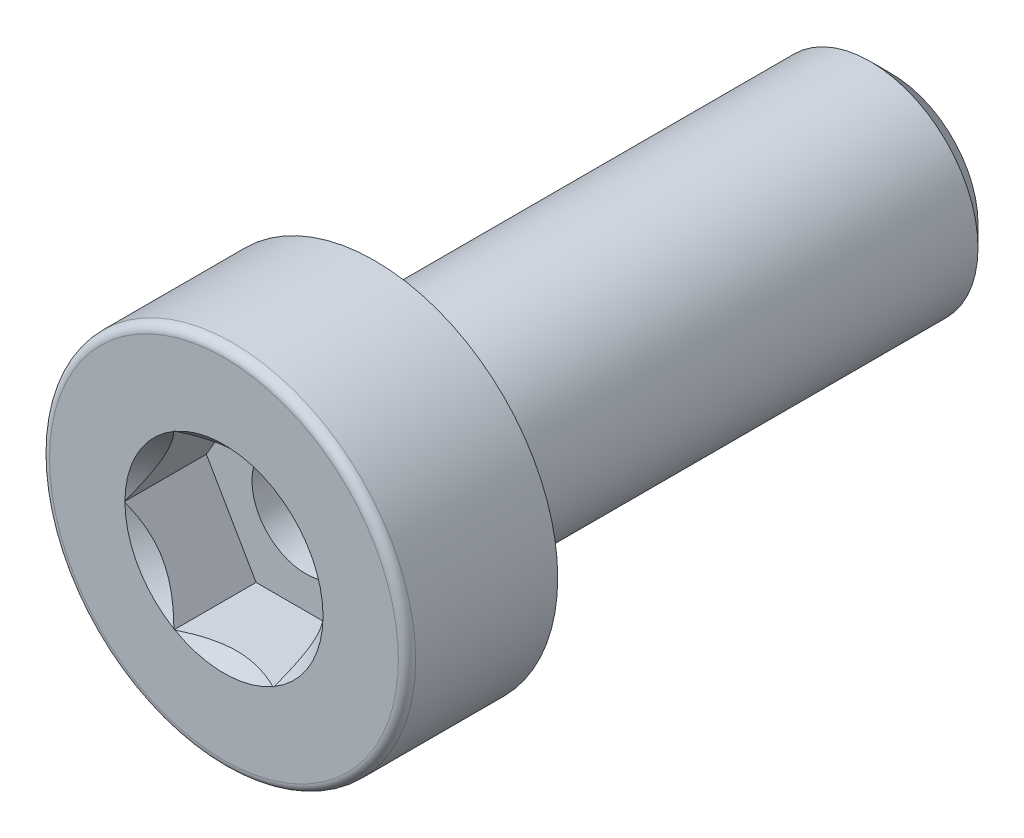
ISO-10303-21;
HEADER;
FILE_DESCRIPTION(('STEP AP214'),'2;1');
FILE_NAME('part.step','',(''),(''),'','','');
FILE_SCHEMA(('AUTOMOTIVE_DESIGN { 1 0 10303 214 1 1 1 1 }'));
ENDSEC;
DATA;
#1=APPLICATION_CONTEXT('core data for automotive mechanical design processes');
#2=APPLICATION_PROTOCOL_DEFINITION('international standard','automotive_design',2000,#1);
#3=PRODUCT_CONTEXT('',#1,'mechanical');
#4=PRODUCT('Part','Part','',(#3));
#5=PRODUCT_RELATED_PRODUCT_CATEGORY('part','',(#4));
#6=PRODUCT_DEFINITION_FORMATION('','',#4);
#7=PRODUCT_DEFINITION_CONTEXT('part definition',#1,'design');
#8=PRODUCT_DEFINITION('design','',#6,#7);
#9=PRODUCT_DEFINITION_SHAPE('','',#8);
#10=(LENGTH_UNIT() NAMED_UNIT(*) SI_UNIT(.MILLI.,.METRE.));
#11=(NAMED_UNIT(*) PLANE_ANGLE_UNIT() SI_UNIT($,.RADIAN.));
#12=(NAMED_UNIT(*) SI_UNIT($,.STERADIAN.) SOLID_ANGLE_UNIT());
#13=UNCERTAINTY_MEASURE_WITH_UNIT(LENGTH_MEASURE(1.E-05),#10,'distance_accuracy_value','');
#14=(GEOMETRIC_REPRESENTATION_CONTEXT(3) GLOBAL_UNCERTAINTY_ASSIGNED_CONTEXT((#13)) GLOBAL_UNIT_ASSIGNED_CONTEXT((#10,
#11,#12)) REPRESENTATION_CONTEXT('',''));
#15=CARTESIAN_POINT('',(0.,0.,0.));
#16=DIRECTION('',(0.,0.,1.));
#17=DIRECTION('',(1.,0.,0.));
#18=AXIS2_PLACEMENT_3D('',#15,#16,#17);
#19=CARTESIAN_POINT('',(15.5,0.,3.49999999991724));
#20=DIRECTION('',(0.,0.,1.));
#21=DIRECTION('',(1.,0.,0.));
#22=AXIS2_PLACEMENT_3D('',#19,#20,#21);
#23=CONICAL_SURFACE('',#22,1.2499999997176,1.0471975509);
#24=CARTESIAN_POINT('',(15.5,0.,3.5));
#25=DIRECTION('',(0.,0.,-1.));
#26=DIRECTION('',(-1.,0.,0.));
#27=AXIS2_PLACEMENT_3D('',#24,#25,#26);
#28=CIRCLE('',#27,1.25);
#29=CARTESIAN_POINT('',(14.25,0.,3.5));
#30=VERTEX_POINT('',#29);
#31=EDGE_CURVE('E387',#30,#30,#28,.F.);
#32=ORIENTED_EDGE('',*,*,#31,.T.);
#33=EDGE_LOOP('',(#32));
#34=FACE_BOUND('',#33,.T.);
#35=CARTESIAN_POINT('',(15.5000000002588,0.,2.77831216348545));
#36=VERTEX_POINT('',#35);
#37=VERTEX_LOOP('',#36);
#38=FACE_BOUND('',#37,.T.);
#39=ADVANCED_FACE('F16',(#34,#38),#23,.F.);
#40=CARTESIAN_POINT('',(15.5,0.,5.5));
#41=DIRECTION('',(0.,0.,-1.));
#42=DIRECTION('',(-1.,0.,0.));
#43=AXIS2_PLACEMENT_3D('',#40,#41,#42);
#44=CYLINDRICAL_SURFACE('',#43,1.25);
#45=ORIENTED_EDGE('',*,*,#31,.F.);
#46=EDGE_LOOP('',(#45));
#47=FACE_BOUND('',#46,.T.);
#48=CARTESIAN_POINT('',(15.5,0.,5.6));
#49=DIRECTION('',(0.,0.,-1.));
#50=DIRECTION('',(-1.,0.,0.));
#51=AXIS2_PLACEMENT_3D('',#48,#49,#50);
#52=CIRCLE('',#51,1.25);
#53=CARTESIAN_POINT('',(14.25,0.,5.6));
#54=VERTEX_POINT('',#53);
#55=EDGE_CURVE('E343',#54,#54,#52,.T.);
#56=ORIENTED_EDGE('',*,*,#55,.F.);
#57=EDGE_LOOP('',(#56));
#58=FACE_BOUND('',#57,.T.);
#59=ADVANCED_FACE('F438',(#47,#58),#44,.F.);
#60=CARTESIAN_POINT('',(15.5,0.,5.6));
#61=DIRECTION('',(0.,0.,1.));
#62=DIRECTION('',(1.,0.,0.));
#63=AXIS2_PLACEMENT_3D('',#60,#61,#62);
#64=PLANE('',#63);
#65=DIRECTION('',(-0.5,0.866025403784439,0.));
#66=VECTOR('',#65,1.);
#67=CARTESIAN_POINT('',(17.8094010767585,0.,5.6));
#68=LINE('',#67,#66);
#69=CARTESIAN_POINT('',(17.8094010767585,0.,5.6));
#70=VERTEX_POINT('',#69);
#71=CARTESIAN_POINT('',(16.6547005383793,1.99999999999999,5.6));
#72=VERTEX_POINT('',#71);
#73=EDGE_CURVE('E318',#70,#72,#68,.T.);
#74=ORIENTED_EDGE('',*,*,#73,.T.);
#75=DIRECTION('',(1.,0.,0.));
#76=VECTOR('',#75,1.);
#77=CARTESIAN_POINT('',(16.6547005383793,2.,5.6));
#78=LINE('',#77,#76);
#79=CARTESIAN_POINT('',(14.3452994616207,2.,5.6));
#80=VERTEX_POINT('',#79);
#81=EDGE_CURVE('E328',#72,#80,#78,.F.);
#82=ORIENTED_EDGE('',*,*,#81,.T.);
#83=DIRECTION('',(-0.5,-0.866025403784439,0.));
#84=VECTOR('',#83,1.);
#85=CARTESIAN_POINT('',(14.3452994616207,2.,5.6));
#86=LINE('',#85,#84);
#87=CARTESIAN_POINT('',(13.1905989232415,0.,5.6));
#88=VERTEX_POINT('',#87);
#89=EDGE_CURVE('E337',#80,#88,#86,.T.);
#90=ORIENTED_EDGE('',*,*,#89,.T.);
#91=DIRECTION('',(0.5,-0.866025403784439,0.));
#92=VECTOR('',#91,1.);
#93=CARTESIAN_POINT('',(13.1905989232415,0.,5.6));
#94=LINE('',#93,#92);
#95=CARTESIAN_POINT('',(14.3452994616207,-1.99999999999999,5.6));
#96=VERTEX_POINT('',#95);
#97=EDGE_CURVE('E128',#88,#96,#94,.T.);
#98=ORIENTED_EDGE('',*,*,#97,.T.);
#99=DIRECTION('',(1.,0.,0.));
#100=VECTOR('',#99,1.);
#101=CARTESIAN_POINT('',(14.3452994616207,-2.,5.6));
#102=LINE('',#101,#100);
#103=CARTESIAN_POINT('',(16.6547005383793,-2.,5.6));
#104=VERTEX_POINT('',#103);
#105=EDGE_CURVE('E348',#96,#104,#102,.T.);
#106=ORIENTED_EDGE('',*,*,#105,.T.);
#107=DIRECTION('',(0.5,0.866025403784439,0.));
#108=VECTOR('',#107,1.);
#109=CARTESIAN_POINT('',(16.6547005383793,-2.,5.6));
#110=LINE('',#109,#108);
#111=EDGE_CURVE('E308',#104,#70,#110,.T.);
#112=ORIENTED_EDGE('',*,*,#111,.T.);
#113=EDGE_LOOP('',(#74,#82,#90,#98,#106,#112));
#114=FACE_BOUND('',#113,.T.);
#115=ORIENTED_EDGE('',*,*,#55,.T.);
#116=EDGE_LOOP('',(#115));
#117=FACE_BOUND('',#116,.T.);
#118=ADVANCED_FACE('F435',(#114,#117),#64,.T.);
#119=CARTESIAN_POINT('',(13.1905989232415,0.,7.5));
#120=DIRECTION('',(-0.866025403784439,-0.5,0.));
#121=DIRECTION('',(0.5,-0.866025403784439,0.));
#122=AXIS2_PLACEMENT_3D('',#119,#120,#121);
#123=PLANE('',#122);
#124=DIRECTION('',(0.5,-0.866025403784439,0.));
#125=VECTOR('',#124,1.);
#126=CARTESIAN_POINT('',(13.1905989232415,0.,7.5));
#127=LINE('',#126,#125);
#128=CARTESIAN_POINT('',(14.3452994616207,-1.99999999999999,7.5));
#129=VERTEX_POINT('',#128);
#130=CARTESIAN_POINT('',(14.3358400270295,-1.9836157786771,7.49999999998885));
#131=VERTEX_POINT('',#130);
#132=EDGE_CURVE('E119',#129,#131,#127,.F.);
#133=ORIENTED_EDGE('',*,*,#132,.F.);
#134=DIRECTION('',(0.,0.,-1.));
#135=VECTOR('',#134,1.);
#136=CARTESIAN_POINT('',(14.3452994616207,-2.,7.5));
#137=LINE('',#136,#135);
#138=EDGE_CURVE('E298',#129,#96,#137,.T.);
#139=ORIENTED_EDGE('',*,*,#138,.T.);
#140=ORIENTED_EDGE('',*,*,#97,.F.);
#141=DIRECTION('',(0.,0.,1.));
#142=VECTOR('',#141,1.);
#143=CARTESIAN_POINT('',(13.1905989232415,0.,7.5));
#144=LINE('',#143,#142);
#145=CARTESIAN_POINT('',(13.1905989232415,0.,7.5));
#146=VERTEX_POINT('',#145);
#147=EDGE_CURVE('E333',#88,#146,#144,.T.);
#148=ORIENTED_EDGE('',*,*,#147,.T.);
#149=DIRECTION('',(0.5,-0.866025403784439,0.));
#150=VECTOR('',#149,1.);
#151=CARTESIAN_POINT('',(13.1905989232415,0.,7.5));
#152=LINE('',#151,#150);
#153=CARTESIAN_POINT('',(13.2000583578327,-0.0163842213229064,7.49999999998884));
#154=VERTEX_POINT('',#153);
#155=EDGE_CURVE('E113',#154,#146,#152,.F.);
#156=ORIENTED_EDGE('',*,*,#155,.F.);
#157=CARTESIAN_POINT('',(13.2000583578463,-0.0163842213417562,7.49999999997869));
#158=CARTESIAN_POINT('',(13.2391841252196,-0.0841520383204332,7.46139126551529));
#159=CARTESIAN_POINT('',(13.2789583547345,-0.153043024673416,7.42509450591591));
#160=CARTESIAN_POINT('',(13.3600294371282,-0.293462258404636,7.35871592055915));
#161=CARTESIAN_POINT('',(13.401333516474,-0.365003022391175,7.32866971216273));
#162=CARTESIAN_POINT('',(13.4846145969375,-0.50925008506292,7.27724746085434));
#163=CARTESIAN_POINT('',(13.5265716753271,-0.581921876570894,7.25574596548101));
#164=CARTESIAN_POINT('',(13.6113818208177,-0.728817357558076,7.22266553527469));
#165=CARTESIAN_POINT('',(13.6542324998209,-0.80303691073037,7.2110629454747));
#166=CARTESIAN_POINT('',(13.7285536802689,-0.931764971344884,7.20057444947973));
#167=CARTESIAN_POINT('',(13.7599355997019,-0.986120050241787,7.19908068822313));
#168=CARTESIAN_POINT('',(13.8226427676828,-1.09473205118354,7.20200867398585));
#169=CARTESIAN_POINT('',(13.8539679930386,-1.14898893305822,7.20643245489716));
#170=CARTESIAN_POINT('',(13.9163159125854,-1.25697869745949,7.22094215811644));
#171=CARTESIAN_POINT('',(13.9473382530807,-1.3107109673671,7.23103404383934));
#172=CARTESIAN_POINT('',(14.008846809773,-1.41724691265832,7.25633229226997));
#173=CARTESIAN_POINT('',(14.0393330689068,-1.47005066241089,7.2715382433899));
#174=CARTESIAN_POINT('',(14.1155007273443,-1.60197691671824,7.31551246780065));
#175=CARTESIAN_POINT('',(14.1607532237502,-1.68035653966256,7.34720930819536));
#176=CARTESIAN_POINT('',(14.2495490778406,-1.8341554704485,7.41837525258773));
#177=CARTESIAN_POINT('',(14.2930975421851,-1.90958362328479,7.45781859299645));
#178=CARTESIAN_POINT('',(14.3358400270181,-1.98361577865738,7.4999999999776));
#179=B_SPLINE_CURVE_WITH_KNOTS('',3,(#157,#158,#159,#160,#161,#162,#163,#164,#165,#166,#167,
#168,#169,#170,#171,#172,#173,#174,#175,#176,#177,#178),.UNSPECIFIED.,.F.,.F.,(4,2,2,2,2,2,2,2,
2,2,4),(0.,0.261948226148952,0.525350520146531,0.784728452727885,1.04348481149605,
1.23156297176626,1.41970579215339,1.60804692946322,1.79637291241682,2.08361007423832,
2.36990763376431),.UNSPECIFIED.);
#180=EDGE_CURVE('E130',#154,#131,#179,.T.);
#181=ORIENTED_EDGE('',*,*,#180,.T.);
#182=EDGE_LOOP('',(#133,#139,#140,#148,#156,#181));
#183=FACE_BOUND('',#182,.T.);
#184=ADVANCED_FACE('F131',(#183),#123,.F.);
#185=CARTESIAN_POINT('',(14.3452994616207,2.,7.5));
#186=DIRECTION('',(-0.866025403784439,0.5,0.));
#187=DIRECTION('',(-0.5,-0.866025403784439,0.));
#188=AXIS2_PLACEMENT_3D('',#185,#186,#187);
#189=PLANE('',#188);
#190=DIRECTION('',(-0.5,-0.866025403784439,0.));
#191=VECTOR('',#190,1.);
#192=CARTESIAN_POINT('',(14.3452994616207,2.,7.5));
#193=LINE('',#192,#191);
#194=CARTESIAN_POINT('',(13.2000583578327,0.0163842213229675,7.49999999998886));
#195=VERTEX_POINT('',#194);
#196=EDGE_CURVE('E329',#146,#195,#193,.F.);
#197=ORIENTED_EDGE('',*,*,#196,.F.);
#198=ORIENTED_EDGE('',*,*,#147,.F.);
#199=ORIENTED_EDGE('',*,*,#89,.F.);
#200=DIRECTION('',(0.,0.,1.));
#201=VECTOR('',#200,1.);
#202=CARTESIAN_POINT('',(14.3452994616207,2.,7.5));
#203=LINE('',#202,#201);
#204=CARTESIAN_POINT('',(14.3452994616207,2.,7.5));
#205=VERTEX_POINT('',#204);
#206=EDGE_CURVE('E323',#80,#205,#203,.T.);
#207=ORIENTED_EDGE('',*,*,#206,.T.);
#208=DIRECTION('',(-0.5,-0.866025403784439,0.));
#209=VECTOR('',#208,1.);
#210=CARTESIAN_POINT('',(14.3452994616207,2.,7.5));
#211=LINE('',#210,#209);
#212=CARTESIAN_POINT('',(14.3358400270295,1.98361577867708,7.49999999998886));
#213=VERTEX_POINT('',#212);
#214=EDGE_CURVE('E127',#213,#205,#211,.F.);
#215=ORIENTED_EDGE('',*,*,#214,.F.);
#216=CARTESIAN_POINT('',(14.3358400270199,1.98361577865595,7.49999999997874));
#217=CARTESIAN_POINT('',(14.296714259644,1.91584796167876,7.46139126551533));
#218=CARTESIAN_POINT('',(14.2569400301281,1.84695697532639,7.42509450591596));
#219=CARTESIAN_POINT('',(14.1758689477337,1.70653774159561,7.35871592055919));
#220=CARTESIAN_POINT('',(14.1345648683881,1.63499697760891,7.32866971216278));
#221=CARTESIAN_POINT('',(14.0512837879248,1.49074991493705,7.27724746085438));
#222=CARTESIAN_POINT('',(14.0093267095352,1.41807812342911,7.25574596548105));
#223=CARTESIAN_POINT('',(13.9245165640445,1.27118264244196,7.22266553527473));
#224=CARTESIAN_POINT('',(13.8816658850413,1.19696308926966,7.21106294547474));
#225=CARTESIAN_POINT('',(13.8073447045933,1.06823502865514,7.20057444947977));
#226=CARTESIAN_POINT('',(13.7759627851603,1.01387994975823,7.19908068822317));
#227=CARTESIAN_POINT('',(13.7132556171794,0.905267948816477,7.2020086739859));
#228=CARTESIAN_POINT('',(13.6819303918236,0.8510110669418,7.2064324548972));
#229=CARTESIAN_POINT('',(13.6195824722769,0.743021302540531,7.22094215811648));
#230=CARTESIAN_POINT('',(13.5885601317815,0.689289032632917,7.23103404383939));
#231=CARTESIAN_POINT('',(13.5270515750893,0.582753087341689,7.25633229227001));
#232=CARTESIAN_POINT('',(13.4965653159554,0.529949337589121,7.27153824338994));
#233=CARTESIAN_POINT('',(13.4203976575179,0.398023083281777,7.31551246780069));
#234=CARTESIAN_POINT('',(13.375145161112,0.319643460337462,7.34720930819539));
#235=CARTESIAN_POINT('',(13.2863493070217,0.165844529551535,7.41837525258776));
#236=CARTESIAN_POINT('',(13.2428008426772,0.090416376715251,7.45781859299647));
#237=CARTESIAN_POINT('',(13.2000583578441,0.0163842213426684,7.49999999997762));
#238=B_SPLINE_CURVE_WITH_KNOTS('',3,(#216,#217,#218,#219,#220,#221,#222,#223,#224,#225,#226,
#227,#228,#229,#230,#231,#232,#233,#234,#235,#236,#237),.UNSPECIFIED.,.F.,.F.,(4,2,2,2,2,2,2,2,
2,2,4),(0.,0.261948226148953,0.525350520146534,0.784728452727887,1.04348481149605,
1.23156297176626,1.4197057921534,1.60804692946323,1.79637291241684,2.08361007423831,
2.36990763376428),.UNSPECIFIED.);
#239=EDGE_CURVE('E133',#213,#195,#238,.T.);
#240=ORIENTED_EDGE('',*,*,#239,.T.);
#241=EDGE_LOOP('',(#197,#198,#199,#207,#215,#240));
#242=FACE_BOUND('',#241,.T.);
#243=ADVANCED_FACE('F204',(#242),#189,.F.);
#244=CARTESIAN_POINT('',(16.6547005383793,2.,7.5));
#245=DIRECTION('',(0.,1.,0.));
#246=DIRECTION('',(0.,0.,1.));
#247=AXIS2_PLACEMENT_3D('',#244,#245,#246);
#248=PLANE('',#247);
#249=DIRECTION('',(1.,0.,0.));
#250=VECTOR('',#249,1.);
#251=CARTESIAN_POINT('',(16.6547005383793,2.,7.5));
#252=LINE('',#251,#250);
#253=CARTESIAN_POINT('',(14.3642183308032,2.,7.49999999998885));
#254=VERTEX_POINT('',#253);
#255=EDGE_CURVE('E319',#205,#254,#252,.T.);
#256=ORIENTED_EDGE('',*,*,#255,.F.);
#257=ORIENTED_EDGE('',*,*,#206,.F.);
#258=ORIENTED_EDGE('',*,*,#81,.F.);
#259=DIRECTION('',(0.,0.,1.));
#260=VECTOR('',#259,1.);
#261=CARTESIAN_POINT('',(16.6547005383793,1.99999999999998,7.5));
#262=LINE('',#261,#260);
#263=CARTESIAN_POINT('',(16.6547005383793,1.99999999999999,7.5));
#264=VERTEX_POINT('',#263);
#265=EDGE_CURVE('E313',#72,#264,#262,.T.);
#266=ORIENTED_EDGE('',*,*,#265,.T.);
#267=DIRECTION('',(1.,0.,0.));
#268=VECTOR('',#267,1.);
#269=CARTESIAN_POINT('',(16.6547005383793,2.,7.5));
#270=LINE('',#269,#268);
#271=CARTESIAN_POINT('',(16.6357816691968,2.,7.49999999998885));
#272=VERTEX_POINT('',#271);
#273=EDGE_CURVE('E326',#272,#264,#270,.T.);
#274=ORIENTED_EDGE('',*,*,#273,.F.);
#275=CARTESIAN_POINT('',(16.6357816691737,1.9999999999977,7.49999999997871));
#276=CARTESIAN_POINT('',(16.5575301344245,1.99999999999917,7.46139126551531));
#277=CARTESIAN_POINT('',(16.4779816753936,1.99999999999978,7.42509450591593));
#278=CARTESIAN_POINT('',(16.3158395106056,2.00000000000022,7.35871592055916));
#279=CARTESIAN_POINT('',(16.2332313519142,2.00000000000006,7.32866971216274));
#280=CARTESIAN_POINT('',(16.0666691909874,1.99999999999994,7.27724746085434));
#281=CARTESIAN_POINT('',(15.9827550342082,1.99999999999998,7.25574596548101));
#282=CARTESIAN_POINT('',(15.8131347432268,2.00000000000002,7.22266553527469));
#283=CARTESIAN_POINT('',(15.7274333852205,2.,7.2110629454747));
#284=CARTESIAN_POINT('',(15.5787910243244,2.,7.20057444947973));
#285=CARTESIAN_POINT('',(15.5160271854585,2.,7.19908068822313));
#286=CARTESIAN_POINT('',(15.3906128494966,2.,7.20200867398585));
#287=CARTESIAN_POINT('',(15.3279623987851,2.,7.20643245489716));
#288=CARTESIAN_POINT('',(15.2032665596915,2.,7.22094215811644));
#289=CARTESIAN_POINT('',(15.1412218787009,2.,7.23103404383935));
#290=CARTESIAN_POINT('',(15.0182047653163,2.,7.25633229226997));
#291=CARTESIAN_POINT('',(14.9572322470486,2.,7.2715382433899));
#292=CARTESIAN_POINT('',(14.8048969301736,2.,7.31551246780066));
#293=CARTESIAN_POINT('',(14.7143919373618,2.,7.34720930819536));
#294=CARTESIAN_POINT('',(14.5368002291811,2.,7.41837525258774));
#295=CARTESIAN_POINT('',(14.4497033004921,2.,7.45781859299646));
#296=CARTESIAN_POINT('',(14.364218330826,2.,7.49999999997761));
#297=B_SPLINE_CURVE_WITH_KNOTS('',3,(#275,#276,#277,#278,#279,#280,#281,#282,#283,#284,#285,
#286,#287,#288,#289,#290,#291,#292,#293,#294,#295,#296),.UNSPECIFIED.,.F.,.F.,(4,2,2,2,2,2,2,2,
2,2,4),(0.,0.26194822614896,0.525350520146549,0.78472845272792,1.04348481149609,1.2315629717663,
1.41970579215344,1.60804692946327,1.79637291241687,2.08361007423837,2.36990763376436),.UNSPECIFIED.);
#298=EDGE_CURVE('E188',#272,#254,#297,.T.);
#299=ORIENTED_EDGE('',*,*,#298,.T.);
#300=EDGE_LOOP('',(#256,#257,#258,#266,#274,#299));
#301=FACE_BOUND('',#300,.T.);
#302=ADVANCED_FACE('F198',(#301),#248,.F.);
#303=CARTESIAN_POINT('',(17.8094010767585,0.,7.5));
#304=DIRECTION('',(0.866025403784439,0.5,0.));
#305=DIRECTION('',(-0.5,0.866025403784439,0.));
#306=AXIS2_PLACEMENT_3D('',#303,#304,#305);
#307=PLANE('',#306);
#308=DIRECTION('',(-0.5,0.866025403784439,0.));
#309=VECTOR('',#308,1.);
#310=CARTESIAN_POINT('',(17.8094010767585,0.,7.5));
#311=LINE('',#310,#309);
#312=CARTESIAN_POINT('',(16.6641599729705,1.9836157786771,7.49999999998885));
#313=VERTEX_POINT('',#312);
#314=EDGE_CURVE('E309',#264,#313,#311,.F.);
#315=ORIENTED_EDGE('',*,*,#314,.F.);
#316=ORIENTED_EDGE('',*,*,#265,.F.);
#317=ORIENTED_EDGE('',*,*,#73,.F.);
#318=DIRECTION('',(0.,0.,1.));
#319=VECTOR('',#318,1.);
#320=CARTESIAN_POINT('',(17.8094010767585,0.,7.5));
#321=LINE('',#320,#319);
#322=CARTESIAN_POINT('',(17.8094010767585,0.,7.5));
#323=VERTEX_POINT('',#322);
#324=EDGE_CURVE('E303',#70,#323,#321,.T.);
#325=ORIENTED_EDGE('',*,*,#324,.T.);
#326=DIRECTION('',(-0.5,0.866025403784439,0.));
#327=VECTOR('',#326,1.);
#328=CARTESIAN_POINT('',(17.8094010767585,0.,7.5));
#329=LINE('',#328,#327);
#330=CARTESIAN_POINT('',(17.7999416421673,0.0163842213229074,7.49999999998884));
#331=VERTEX_POINT('',#330);
#332=EDGE_CURVE('E316',#331,#323,#329,.F.);
#333=ORIENTED_EDGE('',*,*,#332,.F.);
#334=CARTESIAN_POINT('',(17.7999416421537,0.016384221341757,7.49999999997869));
#335=CARTESIAN_POINT('',(17.7608158747804,0.0841520383204335,7.46139126551529));
#336=CARTESIAN_POINT('',(17.7210416452655,0.153043024673416,7.42509450591591));
#337=CARTESIAN_POINT('',(17.6399705628718,0.293462258404637,7.35871592055915));
#338=CARTESIAN_POINT('',(17.598666483526,0.365003022391176,7.32866971216273));
#339=CARTESIAN_POINT('',(17.5153854030625,0.509250085062921,7.27724746085434));
#340=CARTESIAN_POINT('',(17.4734283246729,0.581921876570895,7.25574596548101));
#341=CARTESIAN_POINT('',(17.3886181791823,0.728817357558076,7.22266553527469));
#342=CARTESIAN_POINT('',(17.3457675001791,0.803036910730369,7.2110629454747));
#343=CARTESIAN_POINT('',(17.2714463197311,0.931764971344882,7.20057444947973));
#344=CARTESIAN_POINT('',(17.2400644002981,0.986120050241785,7.19908068822313));
#345=CARTESIAN_POINT('',(17.1773572323172,1.09473205118354,7.20200867398585));
#346=CARTESIAN_POINT('',(17.1460320069614,1.14898893305822,7.20643245489716));
#347=CARTESIAN_POINT('',(17.0836840874146,1.25697869745948,7.22094215811644));
#348=CARTESIAN_POINT('',(17.0526617469193,1.3107109673671,7.23103404383934));
#349=CARTESIAN_POINT('',(16.9911531902271,1.41724691265832,7.25633229226997));
#350=CARTESIAN_POINT('',(16.9606669310932,1.47005066241089,7.2715382433899));
#351=CARTESIAN_POINT('',(16.8844992726557,1.60197691671824,7.31551246780065));
#352=CARTESIAN_POINT('',(16.8392467762498,1.68035653966256,7.34720930819536));
#353=CARTESIAN_POINT('',(16.7504509221594,1.8341554704485,7.41837525258773));
#354=CARTESIAN_POINT('',(16.7069024578149,1.90958362328479,7.45781859299645));
#355=CARTESIAN_POINT('',(16.6641599729819,1.98361577865738,7.4999999999776));
#356=B_SPLINE_CURVE_WITH_KNOTS('',3,(#334,#335,#336,#337,#338,#339,#340,#341,#342,#343,#344,
#345,#346,#347,#348,#349,#350,#351,#352,#353,#354,#355),.UNSPECIFIED.,.F.,.F.,(4,2,2,2,2,2,2,2,
2,2,4),(0.,0.261948226148953,0.525350520146531,0.784728452727883,1.04348481149605,
1.23156297176625,1.41970579215339,1.60804692946322,1.79637291241682,2.08361007423832,
2.36990763376431),.UNSPECIFIED.);
#357=EDGE_CURVE('E181',#331,#313,#356,.T.);
#358=ORIENTED_EDGE('',*,*,#357,.T.);
#359=EDGE_LOOP('',(#315,#316,#317,#325,#333,#358));
#360=FACE_BOUND('',#359,.T.);
#361=ADVANCED_FACE('F194',(#360),#307,.F.);
#362=CARTESIAN_POINT('',(16.6547005383793,-2.,7.5));
#363=DIRECTION('',(0.866025403784439,-0.5,0.));
#364=DIRECTION('',(0.5,0.866025403784439,0.));
#365=AXIS2_PLACEMENT_3D('',#362,#363,#364);
#366=PLANE('',#365);
#367=DIRECTION('',(0.5,0.866025403784439,0.));
#368=VECTOR('',#367,1.);
#369=CARTESIAN_POINT('',(16.6547005383793,-2.,7.5));
#370=LINE('',#369,#368);
#371=CARTESIAN_POINT('',(17.7999416421673,-0.0163842213229666,7.49999999998886));
#372=VERTEX_POINT('',#371);
#373=EDGE_CURVE('E299',#323,#372,#370,.F.);
#374=ORIENTED_EDGE('',*,*,#373,.F.);
#375=ORIENTED_EDGE('',*,*,#324,.F.);
#376=ORIENTED_EDGE('',*,*,#111,.F.);
#377=DIRECTION('',(0.,0.,-1.));
#378=VECTOR('',#377,1.);
#379=CARTESIAN_POINT('',(16.6547005383793,-2.,7.5));
#380=LINE('',#379,#378);
#381=CARTESIAN_POINT('',(16.6547005383793,-2.,7.5));
#382=VERTEX_POINT('',#381);
#383=EDGE_CURVE('E294',#104,#382,#380,.F.);
#384=ORIENTED_EDGE('',*,*,#383,.T.);
#385=DIRECTION('',(0.5,0.866025403784439,0.));
#386=VECTOR('',#385,1.);
#387=CARTESIAN_POINT('',(16.6547005383793,-2.,7.5));
#388=LINE('',#387,#386);
#389=CARTESIAN_POINT('',(16.6641599729705,-1.98361577867708,7.49999999998886));
#390=VERTEX_POINT('',#389);
#391=EDGE_CURVE('E306',#390,#382,#388,.F.);
#392=ORIENTED_EDGE('',*,*,#391,.F.);
#393=CARTESIAN_POINT('',(16.6641599729801,-1.98361577865595,7.49999999997874));
#394=CARTESIAN_POINT('',(16.703285740356,-1.91584796167876,7.46139126551533));
#395=CARTESIAN_POINT('',(16.7430599698719,-1.84695697532639,7.42509450591595));
#396=CARTESIAN_POINT('',(16.8241310522663,-1.70653774159561,7.35871592055919));
#397=CARTESIAN_POINT('',(16.8654351316119,-1.63499697760891,7.32866971216277));
#398=CARTESIAN_POINT('',(16.9487162120752,-1.49074991493704,7.27724746085438));
#399=CARTESIAN_POINT('',(16.9906732904648,-1.41807812342911,7.25574596548105));
#400=CARTESIAN_POINT('',(17.0754834359555,-1.27118264244196,7.22266553527473));
#401=CARTESIAN_POINT('',(17.1183341149587,-1.19696308926966,7.21106294547474));
#402=CARTESIAN_POINT('',(17.1926552954067,-1.06823502865513,7.20057444947977));
#403=CARTESIAN_POINT('',(17.2240372148397,-1.01387994975823,7.19908068822317));
#404=CARTESIAN_POINT('',(17.2867443828206,-0.905267948816477,7.20200867398589));
#405=CARTESIAN_POINT('',(17.3180696081763,-0.8510110669418,7.2064324548972));
#406=CARTESIAN_POINT('',(17.3804175277231,-0.743021302540531,7.22094215811648));
#407=CARTESIAN_POINT('',(17.4114398682185,-0.689289032632918,7.23103404383938));
#408=CARTESIAN_POINT('',(17.4729484249107,-0.58275308734169,7.25633229227001));
#409=CARTESIAN_POINT('',(17.5034346840446,-0.529949337589121,7.27153824338994));
#410=CARTESIAN_POINT('',(17.5796023424821,-0.398023083281775,7.31551246780069));
#411=CARTESIAN_POINT('',(17.624854838888,-0.319643460337461,7.34720930819539));
#412=CARTESIAN_POINT('',(17.7136506929783,-0.165844529551535,7.41837525258776));
#413=CARTESIAN_POINT('',(17.7571991573229,-0.0904163767152519,7.45781859299647));
#414=CARTESIAN_POINT('',(17.7999416421559,-0.0163842213426685,7.49999999997762));
#415=B_SPLINE_CURVE_WITH_KNOTS('',3,(#393,#394,#395,#396,#397,#398,#399,#400,#401,#402,#403,
#404,#405,#406,#407,#408,#409,#410,#411,#412,#413,#414),.UNSPECIFIED.,.F.,.F.,(4,2,2,2,2,2,2,2,
2,2,4),(0.,0.261948226148951,0.525350520146534,0.784728452727889,1.04348481149605,
1.23156297176626,1.4197057921534,1.60804692946323,1.79637291241684,2.08361007423831,
2.36990763376428),.UNSPECIFIED.);
#416=EDGE_CURVE('E144',#390,#372,#415,.T.);
#417=ORIENTED_EDGE('',*,*,#416,.T.);
#418=EDGE_LOOP('',(#374,#375,#376,#384,#392,#417));
#419=FACE_BOUND('',#418,.T.);
#420=ADVANCED_FACE('F197',(#419),#366,.F.);
#421=CARTESIAN_POINT('',(14.3452994616207,-2.,7.5));
#422=DIRECTION('',(0.,-1.,0.));
#423=DIRECTION('',(0.,0.,-1.));
#424=AXIS2_PLACEMENT_3D('',#421,#422,#423);
#425=PLANE('',#424);
#426=DIRECTION('',(1.,0.,0.));
#427=VECTOR('',#426,1.);
#428=CARTESIAN_POINT('',(14.3452994616207,-2.,7.5));
#429=LINE('',#428,#427);
#430=CARTESIAN_POINT('',(16.6357816691968,-2.,7.49999999998885));
#431=VERTEX_POINT('',#430);
#432=EDGE_CURVE('E134',#382,#431,#429,.F.);
#433=ORIENTED_EDGE('',*,*,#432,.F.);
#434=ORIENTED_EDGE('',*,*,#383,.F.);
#435=ORIENTED_EDGE('',*,*,#105,.F.);
#436=ORIENTED_EDGE('',*,*,#138,.F.);
#437=DIRECTION('',(1.,0.,0.));
#438=VECTOR('',#437,1.);
#439=CARTESIAN_POINT('',(14.3452994616207,-2.,7.5));
#440=LINE('',#439,#438);
#441=CARTESIAN_POINT('',(14.3642183308032,-2.,7.49999999998885));
#442=VERTEX_POINT('',#441);
#443=EDGE_CURVE('E124',#442,#129,#440,.F.);
#444=ORIENTED_EDGE('',*,*,#443,.F.);
#445=CARTESIAN_POINT('',(14.3642183308263,-1.9999999999977,7.49999999997871));
#446=CARTESIAN_POINT('',(14.4424698655755,-1.99999999999917,7.46139126551531));
#447=CARTESIAN_POINT('',(14.5220183246064,-1.99999999999978,7.42509450591593));
#448=CARTESIAN_POINT('',(14.6841604893944,-2.00000000000022,7.35871592055916));
#449=CARTESIAN_POINT('',(14.7667686480858,-2.00000000000006,7.32866971216274));
#450=CARTESIAN_POINT('',(14.9333308090126,-1.99999999999994,7.27724746085435));
#451=CARTESIAN_POINT('',(15.0172449657918,-1.99999999999998,7.25574596548101));
#452=CARTESIAN_POINT('',(15.1868652567732,-2.00000000000002,7.22266553527469));
#453=CARTESIAN_POINT('',(15.2725666147795,-2.,7.2110629454747));
#454=CARTESIAN_POINT('',(15.4212089756756,-2.,7.20057444947973));
#455=CARTESIAN_POINT('',(15.4839728145415,-2.,7.19908068822313));
#456=CARTESIAN_POINT('',(15.6093871505034,-2.,7.20200867398585));
#457=CARTESIAN_POINT('',(15.6720376012149,-2.,7.20643245489716));
#458=CARTESIAN_POINT('',(15.7967334403085,-2.,7.22094215811644));
#459=CARTESIAN_POINT('',(15.8587781212991,-2.,7.23103404383935));
#460=CARTESIAN_POINT('',(15.9817952346836,-2.,7.25633229226997));
#461=CARTESIAN_POINT('',(16.0427677529514,-2.,7.2715382433899));
#462=CARTESIAN_POINT('',(16.1951030698264,-2.,7.31551246780065));
#463=CARTESIAN_POINT('',(16.2856080626382,-2.,7.34720930819536));
#464=CARTESIAN_POINT('',(16.4631997708189,-2.,7.41837525258773));
#465=CARTESIAN_POINT('',(16.5502966995079,-2.,7.45781859299645));
#466=CARTESIAN_POINT('',(16.635781669174,-2.,7.49999999997761));
#467=B_SPLINE_CURVE_WITH_KNOTS('',3,(#445,#446,#447,#448,#449,#450,#451,#452,#453,#454,#455,
#456,#457,#458,#459,#460,#461,#462,#463,#464,#465,#466),.UNSPECIFIED.,.F.,.F.,(4,2,2,2,2,2,2,2,
2,2,4),(0.,0.26194822614896,0.525350520146547,0.784728452727909,1.04348481149608,
1.23156297176629,1.41970579215343,1.60804692946325,1.79637291241686,2.08361007423837,
2.36990763376436),.UNSPECIFIED.);
#468=EDGE_CURVE('E138',#442,#431,#467,.T.);
#469=ORIENTED_EDGE('',*,*,#468,.T.);
#470=EDGE_LOOP('',(#433,#434,#435,#436,#444,#469));
#471=FACE_BOUND('',#470,.T.);
#472=ADVANCED_FACE('F159',(#471),#425,.F.);
#473=CARTESIAN_POINT('',(15.5,0.,7.49999999999318));
#474=DIRECTION('',(0.,0.,1.));
#475=DIRECTION('',(1.,0.,0.));
#476=AXIS2_PLACEMENT_3D('',#473,#474,#475);
#477=CONICAL_SURFACE('',#476,2.30000000002246,0.785398163303275);
#478=CARTESIAN_POINT('',(15.5,0.,7.49999999999318));
#479=DIRECTION('',(0.,0.,1.));
#480=DIRECTION('',(1.,0.,0.));
#481=AXIS2_PLACEMENT_3D('',#478,#479,#480);
#482=CIRCLE('',#481,2.30000000002246);
#483=EDGE_CURVE('E122',#131,#154,#482,.F.);
#484=ORIENTED_EDGE('',*,*,#483,.F.);
#485=ORIENTED_EDGE('',*,*,#180,.F.);
#486=EDGE_LOOP('',(#484,#485));
#487=FACE_BOUND('',#486,.T.);
#488=ADVANCED_FACE('F136',(#487),#477,.F.);
#489=CARTESIAN_POINT('',(15.5,0.,7.49999999999318));
#490=DIRECTION('',(0.,0.,1.));
#491=DIRECTION('',(1.,0.,0.));
#492=AXIS2_PLACEMENT_3D('',#489,#490,#491);
#493=CONICAL_SURFACE('',#492,2.30000000002246,0.785398163303275);
#494=CARTESIAN_POINT('',(15.5,0.,7.49999999999318));
#495=DIRECTION('',(0.,0.,1.));
#496=DIRECTION('',(1.,0.,0.));
#497=AXIS2_PLACEMENT_3D('',#494,#495,#496);
#498=CIRCLE('',#497,2.30000000002246);
#499=EDGE_CURVE('E137',#195,#213,#498,.F.);
#500=ORIENTED_EDGE('',*,*,#499,.F.);
#501=ORIENTED_EDGE('',*,*,#239,.F.);
#502=EDGE_LOOP('',(#500,#501));
#503=FACE_BOUND('',#502,.T.);
#504=ADVANCED_FACE('F220',(#503),#493,.F.);
#505=CARTESIAN_POINT('',(15.5,0.,7.49999999999318));
#506=DIRECTION('',(0.,0.,1.));
#507=DIRECTION('',(1.,0.,0.));
#508=AXIS2_PLACEMENT_3D('',#505,#506,#507);
#509=CONICAL_SURFACE('',#508,2.30000000002246,0.785398163303275);
#510=CARTESIAN_POINT('',(15.5,0.,7.49999999999318));
#511=DIRECTION('',(0.,0.,1.));
#512=DIRECTION('',(1.,0.,0.));
#513=AXIS2_PLACEMENT_3D('',#510,#511,#512);
#514=CIRCLE('',#513,2.30000000002246);
#515=EDGE_CURVE('E141',#254,#272,#514,.F.);
#516=ORIENTED_EDGE('',*,*,#515,.F.);
#517=ORIENTED_EDGE('',*,*,#298,.F.);
#518=EDGE_LOOP('',(#516,#517));
#519=FACE_BOUND('',#518,.T.);
#520=ADVANCED_FACE('F177',(#519),#509,.F.);
#521=CARTESIAN_POINT('',(15.5,0.,7.49999999999318));
#522=DIRECTION('',(0.,0.,1.));
#523=DIRECTION('',(1.,0.,0.));
#524=AXIS2_PLACEMENT_3D('',#521,#522,#523);
#525=CONICAL_SURFACE('',#524,2.30000000002246,0.785398163303275);
#526=CARTESIAN_POINT('',(15.5,0.,7.49999999999318));
#527=DIRECTION('',(0.,0.,1.));
#528=DIRECTION('',(1.,0.,0.));
#529=AXIS2_PLACEMENT_3D('',#526,#527,#528);
#530=CIRCLE('',#529,2.30000000002246);
#531=EDGE_CURVE('E401',#313,#331,#530,.F.);
#532=ORIENTED_EDGE('',*,*,#531,.F.);
#533=ORIENTED_EDGE('',*,*,#357,.F.);
#534=EDGE_LOOP('',(#532,#533));
#535=FACE_BOUND('',#534,.T.);
#536=ADVANCED_FACE('F172',(#535),#525,.F.);
#537=CARTESIAN_POINT('',(15.5,0.,7.49999999999318));
#538=DIRECTION('',(0.,0.,1.));
#539=DIRECTION('',(1.,0.,0.));
#540=AXIS2_PLACEMENT_3D('',#537,#538,#539);
#541=CONICAL_SURFACE('',#540,2.30000000002246,0.785398163303275);
#542=CARTESIAN_POINT('',(15.5,0.,7.49999999999318));
#543=DIRECTION('',(0.,0.,1.));
#544=DIRECTION('',(1.,0.,0.));
#545=AXIS2_PLACEMENT_3D('',#542,#543,#544);
#546=CIRCLE('',#545,2.30000000002246);
#547=EDGE_CURVE('E398',#372,#390,#546,.F.);
#548=ORIENTED_EDGE('',*,*,#547,.F.);
#549=ORIENTED_EDGE('',*,*,#416,.F.);
#550=EDGE_LOOP('',(#548,#549));
#551=FACE_BOUND('',#550,.T.);
#552=ADVANCED_FACE('F166',(#551),#541,.F.);
#553=CARTESIAN_POINT('',(15.5,0.,7.49999999999318));
#554=DIRECTION('',(0.,0.,1.));
#555=DIRECTION('',(1.,0.,0.));
#556=AXIS2_PLACEMENT_3D('',#553,#554,#555);
#557=CONICAL_SURFACE('',#556,2.30000000002246,0.785398163303275);
#558=CARTESIAN_POINT('',(15.5,0.,7.49999999999318));
#559=DIRECTION('',(0.,0.,1.));
#560=DIRECTION('',(1.,0.,0.));
#561=AXIS2_PLACEMENT_3D('',#558,#559,#560);
#562=CIRCLE('',#561,2.30000000002246);
#563=EDGE_CURVE('E396',#431,#442,#562,.F.);
#564=ORIENTED_EDGE('',*,*,#563,.F.);
#565=ORIENTED_EDGE('',*,*,#468,.F.);
#566=EDGE_LOOP('',(#564,#565));
#567=FACE_BOUND('',#566,.T.);
#568=ADVANCED_FACE('F162',(#567),#557,.F.);
#569=CARTESIAN_POINT('',(18.675,0.,7.5));
#570=DIRECTION('',(0.,0.,1.));
#571=DIRECTION('',(1.,0.,0.));
#572=AXIS2_PLACEMENT_3D('',#569,#570,#571);
#573=PLANE('',#572);
#574=ORIENTED_EDGE('',*,*,#432,.T.);
#575=ORIENTED_EDGE('',*,*,#563,.T.);
#576=ORIENTED_EDGE('',*,*,#443,.T.);
#577=ORIENTED_EDGE('',*,*,#132,.T.);
#578=ORIENTED_EDGE('',*,*,#483,.T.);
#579=ORIENTED_EDGE('',*,*,#155,.T.);
#580=ORIENTED_EDGE('',*,*,#196,.T.);
#581=ORIENTED_EDGE('',*,*,#499,.T.);
#582=ORIENTED_EDGE('',*,*,#214,.T.);
#583=ORIENTED_EDGE('',*,*,#255,.T.);
#584=ORIENTED_EDGE('',*,*,#515,.T.);
#585=ORIENTED_EDGE('',*,*,#273,.T.);
#586=ORIENTED_EDGE('',*,*,#314,.T.);
#587=ORIENTED_EDGE('',*,*,#531,.T.);
#588=ORIENTED_EDGE('',*,*,#332,.T.);
#589=ORIENTED_EDGE('',*,*,#373,.T.);
#590=ORIENTED_EDGE('',*,*,#547,.T.);
#591=ORIENTED_EDGE('',*,*,#391,.T.);
#592=EDGE_LOOP('',(#574,#575,#576,#577,#578,#579,#580,#581,#582,#583,#584,#585,#586,#587,#588,
#589,#590,#591));
#593=FACE_BOUND('',#592,.T.);
#594=CARTESIAN_POINT('',(15.5,0.,7.5));
#595=DIRECTION('',(0.,0.,-1.));
#596=DIRECTION('',(-1.,0.,0.));
#597=AXIS2_PLACEMENT_3D('',#594,#595,#596);
#598=CIRCLE('',#597,4.05);
#599=CARTESIAN_POINT('',(11.45,0.,7.5));
#600=VERTEX_POINT('',#599);
#601=CARTESIAN_POINT('',(19.55,0.,7.5));
#602=VERTEX_POINT('',#601);
#603=EDGE_CURVE('E35',#600,#602,#598,.T.);
#604=ORIENTED_EDGE('',*,*,#603,.F.);
#605=CARTESIAN_POINT('',(15.5,0.,7.5));
#606=DIRECTION('',(0.,0.,-1.));
#607=DIRECTION('',(1.,0.,0.));
#608=AXIS2_PLACEMENT_3D('',#605,#606,#607);
#609=CIRCLE('',#608,4.05);
#610=EDGE_CURVE('E276',#602,#600,#609,.T.);
#611=ORIENTED_EDGE('',*,*,#610,.F.);
#612=EDGE_LOOP('',(#604,#611));
#613=FACE_BOUND('',#612,.T.);
#614=ADVANCED_FACE('F120',(#593,#613),#573,.T.);
#615=CARTESIAN_POINT('',(15.5,0.,7.3));
#616=DIRECTION('',(0.,0.,1.));
#617=DIRECTION('',(1.,0.,0.));
#618=AXIS2_PLACEMENT_3D('',#615,#616,#617);
#619=TOROIDAL_SURFACE('',#618,4.05,0.199999999999999);
#620=ORIENTED_EDGE('',*,*,#603,.T.);
#621=ORIENTED_EDGE('',*,*,#610,.T.);
#622=EDGE_LOOP('',(#620,#621));
#623=FACE_BOUND('',#622,.T.);
#624=CARTESIAN_POINT('',(15.5,0.,7.3));
#625=DIRECTION('',(0.,0.,-1.));
#626=DIRECTION('',(-1.,0.,0.));
#627=AXIS2_PLACEMENT_3D('',#624,#625,#626);
#628=CIRCLE('',#627,4.25);
#629=CARTESIAN_POINT('',(11.25,0.,7.3));
#630=VERTEX_POINT('',#629);
#631=EDGE_CURVE('E264',#630,#630,#628,.T.);
#632=ORIENTED_EDGE('',*,*,#631,.F.);
#633=EDGE_LOOP('',(#632));
#634=FACE_BOUND('',#633,.T.);
#635=ADVANCED_FACE('F254',(#623,#634),#619,.T.);
#636=CARTESIAN_POINT('',(16.50475,0.,-8.));
#637=DIRECTION('',(0.,0.,-1.));
#638=DIRECTION('',(-1.,0.,0.));
#639=AXIS2_PLACEMENT_3D('',#636,#637,#638);
#640=PLANE('',#639);
#641=CARTESIAN_POINT('',(15.5,0.,-7.99999999998136));
#642=DIRECTION('',(0.,0.,1.));
#643=DIRECTION('',(1.,0.,0.));
#644=AXIS2_PLACEMENT_3D('',#641,#642,#643);
#645=CIRCLE('',#644,2.00950000007379);
#646=CARTESIAN_POINT('',(17.5095000000738,0.,-7.99999999998136));
#647=VERTEX_POINT('',#646);
#648=EDGE_CURVE('E393',#647,#647,#645,.T.);
#649=ORIENTED_EDGE('',*,*,#648,.F.);
#650=EDGE_LOOP('',(#649));
#651=FACE_BOUND('',#650,.T.);
#652=ADVANCED_FACE('F251',(#651),#640,.T.);
#653=CARTESIAN_POINT('',(15.5,0.,5.65));
#654=DIRECTION('',(0.,0.,-1.));
#655=DIRECTION('',(-1.,0.,0.));
#656=AXIS2_PLACEMENT_3D('',#653,#654,#655);
#657=CYLINDRICAL_SURFACE('',#656,4.25);
#658=ORIENTED_EDGE('',*,*,#631,.T.);
#659=EDGE_LOOP('',(#658));
#660=FACE_BOUND('',#659,.T.);
#661=CARTESIAN_POINT('',(15.5,0.,4.));
#662=DIRECTION('',(0.,0.,-1.));
#663=DIRECTION('',(-1.,0.,0.));
#664=AXIS2_PLACEMENT_3D('',#661,#662,#663);
#665=CIRCLE('',#664,4.25);
#666=CARTESIAN_POINT('',(11.25,0.,4.));
#667=VERTEX_POINT('',#666);
#668=EDGE_CURVE('E390',#667,#667,#665,.T.);
#669=ORIENTED_EDGE('',*,*,#668,.F.);
#670=EDGE_LOOP('',(#669));
#671=FACE_BOUND('',#670,.T.);
#672=ADVANCED_FACE('F247',(#660,#671),#657,.T.);
#673=CARTESIAN_POINT('',(15.5,0.,-7.50950000013972));
#674=DIRECTION('',(0.,0.,1.));
#675=DIRECTION('',(1.,0.,0.));
#676=AXIS2_PLACEMENT_3D('',#673,#674,#675);
#677=CONICAL_SURFACE('',#676,2.49999999991542,0.785398163397448);
#678=ORIENTED_EDGE('',*,*,#648,.T.);
#679=EDGE_LOOP('',(#678));
#680=FACE_BOUND('',#679,.T.);
#681=CARTESIAN_POINT('',(15.5,0.,-7.5095));
#682=DIRECTION('',(0.,0.,-1.));
#683=DIRECTION('',(-1.,0.,0.));
#684=AXIS2_PLACEMENT_3D('',#681,#682,#683);
#685=CIRCLE('',#684,2.5);
#686=CARTESIAN_POINT('',(13.,0.,-7.5095));
#687=VERTEX_POINT('',#686);
#688=EDGE_CURVE('E27',#687,#687,#685,.F.);
#689=ORIENTED_EDGE('',*,*,#688,.F.);
#690=EDGE_LOOP('',(#689));
#691=FACE_BOUND('',#690,.T.);
#692=ADVANCED_FACE('F239',(#680,#691),#677,.T.);
#693=CARTESIAN_POINT('',(18.875,0.,4.));
#694=DIRECTION('',(0.,0.,-1.));
#695=DIRECTION('',(-1.,0.,0.));
#696=AXIS2_PLACEMENT_3D('',#693,#694,#695);
#697=PLANE('',#696);
#698=CARTESIAN_POINT('',(15.5,0.,4.));
#699=DIRECTION('',(0.,0.,-1.));
#700=DIRECTION('',(-1.,0.,0.));
#701=AXIS2_PLACEMENT_3D('',#698,#699,#700);
#702=CIRCLE('',#701,2.5);
#703=CARTESIAN_POINT('',(13.,0.,4.));
#704=VERTEX_POINT('',#703);
#705=EDGE_CURVE('E11',#704,#704,#702,.T.);
#706=ORIENTED_EDGE('',*,*,#705,.F.);
#707=EDGE_LOOP('',(#706));
#708=FACE_BOUND('',#707,.T.);
#709=ORIENTED_EDGE('',*,*,#668,.T.);
#710=EDGE_LOOP('',(#709));
#711=FACE_BOUND('',#710,.T.);
#712=ADVANCED_FACE('F233',(#708,#711),#697,.T.);
#713=CARTESIAN_POINT('',(15.5,0.,-1.75475));
#714=DIRECTION('',(0.,0.,-1.));
#715=DIRECTION('',(-1.,0.,0.));
#716=AXIS2_PLACEMENT_3D('',#713,#714,#715);
#717=CYLINDRICAL_SURFACE('',#716,2.5);
#718=ORIENTED_EDGE('',*,*,#688,.T.);
#719=EDGE_LOOP('',(#718));
#720=FACE_BOUND('',#719,.T.);
#721=ORIENTED_EDGE('',*,*,#705,.T.);
#722=EDGE_LOOP('',(#721));
#723=FACE_BOUND('',#722,.T.);
#724=ADVANCED_FACE('F231',(#720,#723),#717,.T.);
#725=CLOSED_SHELL('',(#39,#59,#118,#184,#243,#302,#361,#420,#472,#488,#504,#520,#536,#552,#568,
#614,#635,#652,#672,#692,#712,#724));
#726=MANIFOLD_SOLID_BREP('B1',#725);
#727=ADVANCED_BREP_SHAPE_REPRESENTATION('',(#18,#726),#14);
#728=SHAPE_DEFINITION_REPRESENTATION(#9,#727);
ENDSEC;
END-ISO-10303-21;
